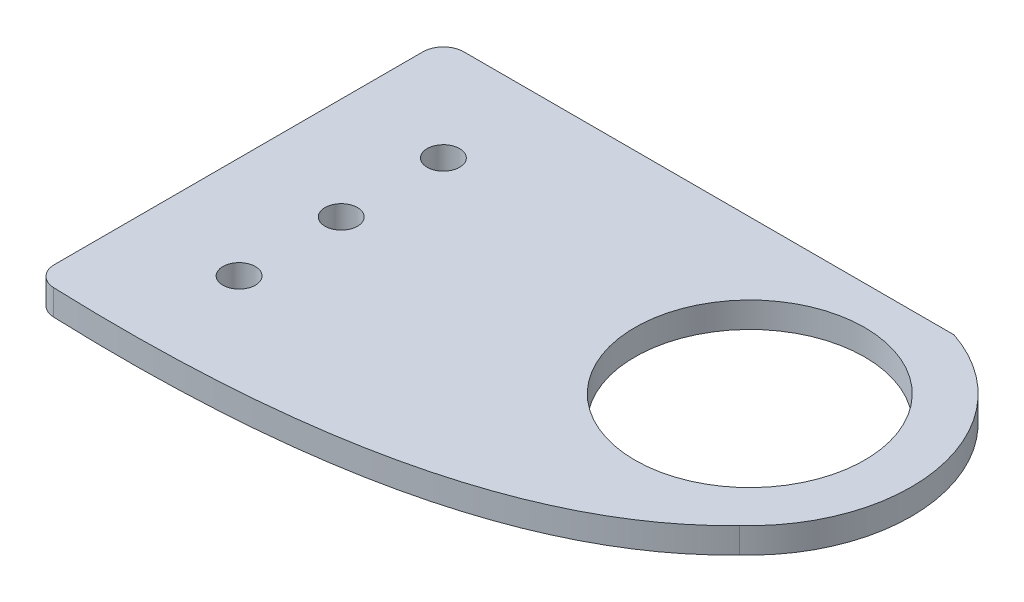
ISO-10303-21;
HEADER;
FILE_DESCRIPTION(('STEP AP214'),'2;1');
FILE_NAME('part.step','',(''),(''),'','','');
FILE_SCHEMA(('AUTOMOTIVE_DESIGN { 1 0 10303 214 1 1 1 1 }'));
ENDSEC;
DATA;
#1=APPLICATION_CONTEXT('core data for automotive mechanical design processes');
#2=APPLICATION_PROTOCOL_DEFINITION('international standard','automotive_design',2000,#1);
#3=PRODUCT_CONTEXT('',#1,'mechanical');
#4=PRODUCT('Part','Part','',(#3));
#5=PRODUCT_RELATED_PRODUCT_CATEGORY('part','',(#4));
#6=PRODUCT_DEFINITION_FORMATION('','',#4);
#7=PRODUCT_DEFINITION_CONTEXT('part definition',#1,'design');
#8=PRODUCT_DEFINITION('design','',#6,#7);
#9=PRODUCT_DEFINITION_SHAPE('','',#8);
#10=(LENGTH_UNIT() NAMED_UNIT(*) SI_UNIT(.MILLI.,.METRE.));
#11=(NAMED_UNIT(*) PLANE_ANGLE_UNIT() SI_UNIT($,.RADIAN.));
#12=(NAMED_UNIT(*) SI_UNIT($,.STERADIAN.) SOLID_ANGLE_UNIT());
#13=UNCERTAINTY_MEASURE_WITH_UNIT(LENGTH_MEASURE(1.E-05),#10,'distance_accuracy_value','');
#14=(GEOMETRIC_REPRESENTATION_CONTEXT(3) GLOBAL_UNCERTAINTY_ASSIGNED_CONTEXT((#13)) GLOBAL_UNIT_ASSIGNED_CONTEXT((#10,
#11,#12)) REPRESENTATION_CONTEXT('',''));
#15=CARTESIAN_POINT('',(0.,0.,0.));
#16=DIRECTION('',(0.,0.,1.));
#17=DIRECTION('',(1.,0.,0.));
#18=AXIS2_PLACEMENT_3D('',#15,#16,#17);
#19=CARTESIAN_POINT('',(-52.3417869138947,3.175,0.));
#20=DIRECTION('',(1.,0.,0.));
#21=DIRECTION('',(0.,0.,-1.));
#22=AXIS2_PLACEMENT_3D('',#19,#20,#21);
#23=PLANE('',#22);
#24=DIRECTION('',(0.,0.,1.));
#25=VECTOR('',#24,1.);
#26=CARTESIAN_POINT('',(-52.3417869138947,3.175,0.));
#27=LINE('',#26,#25);
#28=CARTESIAN_POINT('',(-52.3417869138947,3.175,-18.9267585834413));
#29=VERTEX_POINT('',#28);
#30=CARTESIAN_POINT('',(-52.3417869138947,3.175,26.8967299675417));
#31=VERTEX_POINT('',#30);
#32=EDGE_CURVE('E96',#29,#31,#27,.T.);
#33=ORIENTED_EDGE('',*,*,#32,.F.);
#34=DIRECTION('',(0.,-1.,0.));
#35=VECTOR('',#34,1.);
#36=CARTESIAN_POINT('',(-52.3417869138947,3.175,-18.9267585834413));
#37=LINE('',#36,#35);
#38=CARTESIAN_POINT('',(-52.3417869138947,0.,-18.9267585834413));
#39=VERTEX_POINT('',#38);
#40=EDGE_CURVE('E146',#29,#39,#37,.T.);
#41=ORIENTED_EDGE('',*,*,#40,.T.);
#42=DIRECTION('',(0.,0.,1.));
#43=VECTOR('',#42,1.);
#44=CARTESIAN_POINT('',(-52.3417869138947,0.,0.));
#45=LINE('',#44,#43);
#46=CARTESIAN_POINT('',(-52.3417869138947,0.,26.8967299675417));
#47=VERTEX_POINT('',#46);
#48=EDGE_CURVE('E130',#39,#47,#45,.T.);
#49=ORIENTED_EDGE('',*,*,#48,.T.);
#50=DIRECTION('',(0.,-1.,0.));
#51=VECTOR('',#50,1.);
#52=CARTESIAN_POINT('',(-52.3417869138947,3.175,26.8967299675417));
#53=LINE('',#52,#51);
#54=EDGE_CURVE('E106',#47,#31,#53,.F.);
#55=ORIENTED_EDGE('',*,*,#54,.T.);
#56=EDGE_LOOP('',(#33,#41,#49,#55));
#57=FACE_BOUND('',#56,.T.);
#58=ADVANCED_FACE('F35',(#57),#23,.F.);
#59=CARTESIAN_POINT('',(-52.3417869138947,3.175,29.3332414165587));
#60=CARTESIAN_POINT('',(0.,3.175,31.75));
#61=CARTESIAN_POINT('',(18.3464379120117,3.175,12.4136651651645));
#62=B_SPLINE_CURVE_WITH_KNOTS('',2,(#59,#60,#61),.UNSPECIFIED.,.F.,.F.,(3,3),(0.,1.),.UNSPECIFIED.);
#63=DIRECTION('',(0.,-1.,0.));
#64=VECTOR('',#63,1.);
#65=SURFACE_OF_LINEAR_EXTRUSION('',#62,#64);
#66=CARTESIAN_POINT('',(-49.8955795066343,3.175,29.43499767398));
#67=VERTEX_POINT('',#66);
#68=CARTESIAN_POINT('',(18.3464379120117,3.175,12.4136651651645));
#69=VERTEX_POINT('',#68);
#70=EDGE_CURVE('E89',#67,#69,#62,.T.);
#71=ORIENTED_EDGE('',*,*,#70,.F.);
#72=DIRECTION('',(0.,-1.,0.));
#73=VECTOR('',#72,1.);
#74=CARTESIAN_POINT('',(-49.895579506625,3.175,29.4349976739803));
#75=LINE('',#74,#73);
#76=CARTESIAN_POINT('',(-49.8955795066343,0.,29.43499767398));
#77=VERTEX_POINT('',#76);
#78=EDGE_CURVE('E11',#67,#77,#75,.T.);
#79=ORIENTED_EDGE('',*,*,#78,.T.);
#80=CARTESIAN_POINT('',(-52.3417869138947,0.,29.3332414165587));
#81=CARTESIAN_POINT('',(0.,0.,31.75));
#82=CARTESIAN_POINT('',(18.3464379120117,0.,12.4136651651645));
#83=B_SPLINE_CURVE_WITH_KNOTS('',2,(#80,#81,#82),.UNSPECIFIED.,.F.,.F.,(3,3),(0.,1.),.UNSPECIFIED.);
#84=CARTESIAN_POINT('',(18.3464379120117,0.,12.4136651651645));
#85=VERTEX_POINT('',#84);
#86=EDGE_CURVE('E102',#77,#85,#83,.T.);
#87=ORIENTED_EDGE('',*,*,#86,.T.);
#88=DIRECTION('',(0.,-1.,0.));
#89=VECTOR('',#88,1.);
#90=CARTESIAN_POINT('',(18.3464379120117,3.175,12.4136651651645));
#91=LINE('',#90,#89);
#92=EDGE_CURVE('E99',#69,#85,#91,.T.);
#93=ORIENTED_EDGE('',*,*,#92,.F.);
#94=EDGE_LOOP('',(#71,#79,#87,#93));
#95=FACE_BOUND('',#94,.T.);
#96=ADVANCED_FACE('F100',(#95),#65,.F.);
#97=CARTESIAN_POINT('',(4.80821308610526,3.175,-2.41675858344132));
#98=DIRECTION('',(0.,-1.,0.));
#99=DIRECTION('',(0.,0.,-1.));
#100=AXIS2_PLACEMENT_3D('',#97,#98,#99);
#101=CYLINDRICAL_SURFACE('',#100,20.0804631420692);
#102=CARTESIAN_POINT('',(4.80821308610526,0.,-2.41675858344132));
#103=DIRECTION('',(0.,1.,0.));
#104=DIRECTION('',(0.,0.,1.));
#105=AXIS2_PLACEMENT_3D('',#102,#103,#104);
#106=CIRCLE('',#105,20.0804631420692);
#107=CARTESIAN_POINT('',(11.1582130861053,0.,-21.4667585834413));
#108=VERTEX_POINT('',#107);
#109=EDGE_CURVE('E136',#108,#85,#106,.F.);
#110=ORIENTED_EDGE('',*,*,#109,.F.);
#111=DIRECTION('',(0.,-1.,0.));
#112=VECTOR('',#111,1.);
#113=CARTESIAN_POINT('',(11.1582130861053,3.175,-21.4667585834413));
#114=LINE('',#113,#112);
#115=CARTESIAN_POINT('',(11.1582130861053,3.175,-21.4667585834413));
#116=VERTEX_POINT('',#115);
#117=EDGE_CURVE('E107',#116,#108,#114,.T.);
#118=ORIENTED_EDGE('',*,*,#117,.F.);
#119=CARTESIAN_POINT('',(4.80821308610526,3.175,-2.41675858344132));
#120=DIRECTION('',(0.,1.,0.));
#121=DIRECTION('',(0.,0.,1.));
#122=AXIS2_PLACEMENT_3D('',#119,#120,#121);
#123=CIRCLE('',#122,20.0804631420692);
#124=EDGE_CURVE('E93',#116,#69,#123,.F.);
#125=ORIENTED_EDGE('',*,*,#124,.T.);
#126=ORIENTED_EDGE('',*,*,#92,.T.);
#127=EDGE_LOOP('',(#110,#118,#125,#126));
#128=FACE_BOUND('',#127,.T.);
#129=ADVANCED_FACE('F109',(#128),#101,.T.);
#130=CARTESIAN_POINT('',(-39.6417869138945,3.175,16.6332414165587));
#131=DIRECTION('',(0.,-1.,0.));
#132=DIRECTION('',(0.,0.,-1.));
#133=AXIS2_PLACEMENT_3D('',#130,#131,#132);
#134=CYLINDRICAL_SURFACE('',#133,2.0193);
#135=CARTESIAN_POINT('',(-39.6417869138945,3.175,16.6332414165587));
#136=DIRECTION('',(0.,1.,0.));
#137=DIRECTION('',(0.,0.,1.));
#138=AXIS2_PLACEMENT_3D('',#135,#136,#137);
#139=CIRCLE('',#138,2.0193);
#140=CARTESIAN_POINT('',(-39.6417869138945,3.175,18.6525414165587));
#141=VERTEX_POINT('',#140);
#142=EDGE_CURVE('E161',#141,#141,#139,.T.);
#143=ORIENTED_EDGE('',*,*,#142,.T.);
#144=EDGE_LOOP('',(#143));
#145=FACE_BOUND('',#144,.T.);
#146=CARTESIAN_POINT('',(-39.6417869138945,0.,16.6332414165587));
#147=DIRECTION('',(0.,1.,0.));
#148=DIRECTION('',(0.,0.,1.));
#149=AXIS2_PLACEMENT_3D('',#146,#147,#148);
#150=CIRCLE('',#149,2.0193);
#151=CARTESIAN_POINT('',(-39.6417869138945,0.,18.6525414165587));
#152=VERTEX_POINT('',#151);
#153=EDGE_CURVE('E127',#152,#152,#150,.T.);
#154=ORIENTED_EDGE('',*,*,#153,.F.);
#155=EDGE_LOOP('',(#154));
#156=FACE_BOUND('',#155,.T.);
#157=ADVANCED_FACE('F188',(#145,#156),#134,.F.);
#158=CARTESIAN_POINT('',(-39.6417869138947,3.175,3.93324141655868));
#159=DIRECTION('',(0.,-1.,0.));
#160=DIRECTION('',(0.,0.,-1.));
#161=AXIS2_PLACEMENT_3D('',#158,#159,#160);
#162=CYLINDRICAL_SURFACE('',#161,2.0193);
#163=CARTESIAN_POINT('',(-39.6417869138947,3.175,3.93324141655868));
#164=DIRECTION('',(0.,1.,0.));
#165=DIRECTION('',(0.,0.,1.));
#166=AXIS2_PLACEMENT_3D('',#163,#164,#165);
#167=CIRCLE('',#166,2.0193);
#168=CARTESIAN_POINT('',(-39.6417869138947,3.175,5.95254141655868));
#169=VERTEX_POINT('',#168);
#170=EDGE_CURVE('E287',#169,#169,#167,.T.);
#171=ORIENTED_EDGE('',*,*,#170,.T.);
#172=EDGE_LOOP('',(#171));
#173=FACE_BOUND('',#172,.T.);
#174=CARTESIAN_POINT('',(-39.6417869138947,0.,3.93324141655868));
#175=DIRECTION('',(0.,1.,0.));
#176=DIRECTION('',(0.,0.,1.));
#177=AXIS2_PLACEMENT_3D('',#174,#175,#176);
#178=CIRCLE('',#177,2.0193);
#179=CARTESIAN_POINT('',(-39.6417869138947,0.,5.95254141655868));
#180=VERTEX_POINT('',#179);
#181=EDGE_CURVE('E124',#180,#180,#178,.T.);
#182=ORIENTED_EDGE('',*,*,#181,.F.);
#183=EDGE_LOOP('',(#182));
#184=FACE_BOUND('',#183,.T.);
#185=ADVANCED_FACE('F191',(#173,#184),#162,.F.);
#186=CARTESIAN_POINT('',(-39.6417869138948,3.175,-8.76675858344132));
#187=DIRECTION('',(0.,-1.,0.));
#188=DIRECTION('',(0.,0.,-1.));
#189=AXIS2_PLACEMENT_3D('',#186,#187,#188);
#190=CYLINDRICAL_SURFACE('',#189,2.01930000000012);
#191=CARTESIAN_POINT('',(-39.6417869138948,3.175,-8.76675858344132));
#192=DIRECTION('',(0.,1.,0.));
#193=DIRECTION('',(0.,0.,1.));
#194=AXIS2_PLACEMENT_3D('',#191,#192,#193);
#195=CIRCLE('',#194,2.01930000000012);
#196=CARTESIAN_POINT('',(-39.6417869138948,3.175,-6.74745858344119));
#197=VERTEX_POINT('',#196);
#198=EDGE_CURVE('E285',#197,#197,#195,.T.);
#199=ORIENTED_EDGE('',*,*,#198,.T.);
#200=EDGE_LOOP('',(#199));
#201=FACE_BOUND('',#200,.T.);
#202=CARTESIAN_POINT('',(-39.6417869138948,0.,-8.76675858344132));
#203=DIRECTION('',(0.,1.,0.));
#204=DIRECTION('',(0.,0.,1.));
#205=AXIS2_PLACEMENT_3D('',#202,#203,#204);
#206=CIRCLE('',#205,2.01930000000012);
#207=CARTESIAN_POINT('',(-39.6417869138948,0.,-6.74745858344119));
#208=VERTEX_POINT('',#207);
#209=EDGE_CURVE('E121',#208,#208,#206,.T.);
#210=ORIENTED_EDGE('',*,*,#209,.F.);
#211=EDGE_LOOP('',(#210));
#212=FACE_BOUND('',#211,.T.);
#213=ADVANCED_FACE('F176',(#201,#212),#190,.F.);
#214=CARTESIAN_POINT('',(4.80821308610526,3.175,-2.41675858344132));
#215=DIRECTION('',(0.,-1.,0.));
#216=DIRECTION('',(0.,0.,-1.));
#217=AXIS2_PLACEMENT_3D('',#214,#215,#216);
#218=CYLINDRICAL_SURFACE('',#217,14.2875);
#219=CARTESIAN_POINT('',(4.80821308610526,3.175,-2.41675858344132));
#220=DIRECTION('',(0.,1.,0.));
#221=DIRECTION('',(0.,0.,1.));
#222=AXIS2_PLACEMENT_3D('',#219,#220,#221);
#223=CIRCLE('',#222,14.2875);
#224=CARTESIAN_POINT('',(4.80821308610526,3.175,11.8707414165587));
#225=VERTEX_POINT('',#224);
#226=EDGE_CURVE('E143',#225,#225,#223,.T.);
#227=ORIENTED_EDGE('',*,*,#226,.T.);
#228=EDGE_LOOP('',(#227));
#229=FACE_BOUND('',#228,.T.);
#230=CARTESIAN_POINT('',(4.80821308610526,0.,-2.41675858344132));
#231=DIRECTION('',(0.,1.,0.));
#232=DIRECTION('',(0.,0.,1.));
#233=AXIS2_PLACEMENT_3D('',#230,#231,#232);
#234=CIRCLE('',#233,14.2875);
#235=CARTESIAN_POINT('',(4.80821308610526,0.,11.8707414165587));
#236=VERTEX_POINT('',#235);
#237=EDGE_CURVE('E118',#236,#236,#234,.T.);
#238=ORIENTED_EDGE('',*,*,#237,.F.);
#239=EDGE_LOOP('',(#238));
#240=FACE_BOUND('',#239,.T.);
#241=ADVANCED_FACE('F168',(#229,#240),#218,.F.);
#242=CARTESIAN_POINT('',(0.,3.175,-21.4667585834413));
#243=DIRECTION('',(0.,0.,1.));
#244=DIRECTION('',(1.,0.,0.));
#245=AXIS2_PLACEMENT_3D('',#242,#243,#244);
#246=PLANE('',#245);
#247=DIRECTION('',(-1.,0.,0.));
#248=VECTOR('',#247,1.);
#249=CARTESIAN_POINT('',(0.,0.,-21.4667585834413));
#250=LINE('',#249,#248);
#251=CARTESIAN_POINT('',(-49.8017869138947,0.,-21.4667585834413));
#252=VERTEX_POINT('',#251);
#253=EDGE_CURVE('E141',#108,#252,#250,.T.);
#254=ORIENTED_EDGE('',*,*,#253,.T.);
#255=DIRECTION('',(0.,-1.,0.));
#256=VECTOR('',#255,1.);
#257=CARTESIAN_POINT('',(-49.8017869138947,3.175,-21.4667585834413));
#258=LINE('',#257,#256);
#259=CARTESIAN_POINT('',(-49.8017869138947,3.175,-21.4667585834413));
#260=VERTEX_POINT('',#259);
#261=EDGE_CURVE('E58',#252,#260,#258,.F.);
#262=ORIENTED_EDGE('',*,*,#261,.T.);
#263=DIRECTION('',(-1.,0.,0.));
#264=VECTOR('',#263,1.);
#265=CARTESIAN_POINT('',(0.,3.175,-21.4667585834413));
#266=LINE('',#265,#264);
#267=EDGE_CURVE('E110',#116,#260,#266,.T.);
#268=ORIENTED_EDGE('',*,*,#267,.F.);
#269=ORIENTED_EDGE('',*,*,#117,.T.);
#270=EDGE_LOOP('',(#254,#262,#268,#269));
#271=FACE_BOUND('',#270,.T.);
#272=ADVANCED_FACE('F166',(#271),#246,.F.);
#273=CARTESIAN_POINT('',(0.,3.175,0.));
#274=DIRECTION('',(0.,1.,0.));
#275=DIRECTION('',(0.,0.,1.));
#276=AXIS2_PLACEMENT_3D('',#273,#274,#275);
#277=PLANE('',#276);
#278=ORIENTED_EDGE('',*,*,#226,.F.);
#279=EDGE_LOOP('',(#278));
#280=FACE_BOUND('',#279,.T.);
#281=ORIENTED_EDGE('',*,*,#198,.F.);
#282=EDGE_LOOP('',(#281));
#283=FACE_BOUND('',#282,.T.);
#284=ORIENTED_EDGE('',*,*,#170,.F.);
#285=EDGE_LOOP('',(#284));
#286=FACE_BOUND('',#285,.T.);
#287=ORIENTED_EDGE('',*,*,#142,.F.);
#288=EDGE_LOOP('',(#287));
#289=FACE_BOUND('',#288,.T.);
#290=ORIENTED_EDGE('',*,*,#267,.T.);
#291=CARTESIAN_POINT('',(-49.8017869138947,3.175,-18.9267585834413));
#292=DIRECTION('',(0.,1.,0.));
#293=DIRECTION('',(0.,0.,1.));
#294=AXIS2_PLACEMENT_3D('',#291,#292,#293);
#295=CIRCLE('',#294,2.54);
#296=EDGE_CURVE('E43',#260,#29,#295,.T.);
#297=ORIENTED_EDGE('',*,*,#296,.T.);
#298=ORIENTED_EDGE('',*,*,#32,.T.);
#299=CARTESIAN_POINT('',(-49.8017869138947,3.175,26.8967299675417));
#300=DIRECTION('',(0.,1.,0.));
#301=DIRECTION('',(0.,0.,1.));
#302=AXIS2_PLACEMENT_3D('',#299,#300,#301);
#303=CIRCLE('',#302,2.54);
#304=EDGE_CURVE('E50',#31,#67,#303,.T.);
#305=ORIENTED_EDGE('',*,*,#304,.T.);
#306=ORIENTED_EDGE('',*,*,#70,.T.);
#307=ORIENTED_EDGE('',*,*,#124,.F.);
#308=EDGE_LOOP('',(#290,#297,#298,#305,#306,#307));
#309=FACE_BOUND('',#308,.T.);
#310=ADVANCED_FACE('F91',(#280,#283,#286,#289,#309),#277,.T.);
#311=CARTESIAN_POINT('',(0.,0.,0.));
#312=DIRECTION('',(0.,1.,0.));
#313=DIRECTION('',(0.,0.,1.));
#314=AXIS2_PLACEMENT_3D('',#311,#312,#313);
#315=PLANE('',#314);
#316=ORIENTED_EDGE('',*,*,#237,.T.);
#317=EDGE_LOOP('',(#316));
#318=FACE_BOUND('',#317,.T.);
#319=ORIENTED_EDGE('',*,*,#209,.T.);
#320=EDGE_LOOP('',(#319));
#321=FACE_BOUND('',#320,.T.);
#322=ORIENTED_EDGE('',*,*,#181,.T.);
#323=EDGE_LOOP('',(#322));
#324=FACE_BOUND('',#323,.T.);
#325=ORIENTED_EDGE('',*,*,#153,.T.);
#326=EDGE_LOOP('',(#325));
#327=FACE_BOUND('',#326,.T.);
#328=ORIENTED_EDGE('',*,*,#48,.F.);
#329=CARTESIAN_POINT('',(-49.8017869138947,0.,-18.9267585834413));
#330=DIRECTION('',(0.,1.,0.));
#331=DIRECTION('',(0.,0.,1.));
#332=AXIS2_PLACEMENT_3D('',#329,#330,#331);
#333=CIRCLE('',#332,2.54);
#334=EDGE_CURVE('E151',#39,#252,#333,.F.);
#335=ORIENTED_EDGE('',*,*,#334,.T.);
#336=ORIENTED_EDGE('',*,*,#253,.F.);
#337=ORIENTED_EDGE('',*,*,#109,.T.);
#338=ORIENTED_EDGE('',*,*,#86,.F.);
#339=CARTESIAN_POINT('',(-49.8017869138947,0.,26.8967299675417));
#340=DIRECTION('',(0.,1.,0.));
#341=DIRECTION('',(0.,0.,1.));
#342=AXIS2_PLACEMENT_3D('',#339,#340,#341);
#343=CIRCLE('',#342,2.54);
#344=EDGE_CURVE('E149',#77,#47,#343,.F.);
#345=ORIENTED_EDGE('',*,*,#344,.T.);
#346=EDGE_LOOP('',(#328,#335,#336,#337,#338,#345));
#347=FACE_BOUND('',#346,.T.);
#348=ADVANCED_FACE('F165',(#318,#321,#324,#327,#347),#315,.F.);
#349=CARTESIAN_POINT('',(-49.8017869138947,3.175,-18.9267585834413));
#350=DIRECTION('',(0.,-1.,0.));
#351=DIRECTION('',(0.,0.,-1.));
#352=AXIS2_PLACEMENT_3D('',#349,#350,#351);
#353=CYLINDRICAL_SURFACE('',#352,2.54);
#354=ORIENTED_EDGE('',*,*,#296,.F.);
#355=ORIENTED_EDGE('',*,*,#261,.F.);
#356=ORIENTED_EDGE('',*,*,#334,.F.);
#357=ORIENTED_EDGE('',*,*,#40,.F.);
#358=EDGE_LOOP('',(#354,#355,#356,#357));
#359=FACE_BOUND('',#358,.T.);
#360=ADVANCED_FACE('F162',(#359),#353,.T.);
#361=CARTESIAN_POINT('',(-49.8017869138947,1.5875,26.8967299675417));
#362=DIRECTION('',(0.,-1.,0.));
#363=DIRECTION('',(0.,0.,-1.));
#364=AXIS2_PLACEMENT_3D('',#361,#362,#363);
#365=CYLINDRICAL_SURFACE('',#364,2.54);
#366=ORIENTED_EDGE('',*,*,#304,.F.);
#367=ORIENTED_EDGE('',*,*,#54,.F.);
#368=ORIENTED_EDGE('',*,*,#344,.F.);
#369=ORIENTED_EDGE('',*,*,#78,.F.);
#370=EDGE_LOOP('',(#366,#367,#368,#369));
#371=FACE_BOUND('',#370,.T.);
#372=ADVANCED_FACE('F37',(#371),#365,.T.);
#373=CLOSED_SHELL('',(#58,#96,#129,#157,#185,#213,#241,#272,#310,#348,#360,#372));
#374=MANIFOLD_SOLID_BREP('B2',#373);
#375=ADVANCED_BREP_SHAPE_REPRESENTATION('',(#18,#374),#14);
#376=SHAPE_DEFINITION_REPRESENTATION(#9,#375);
ENDSEC;
END-ISO-10303-21;
